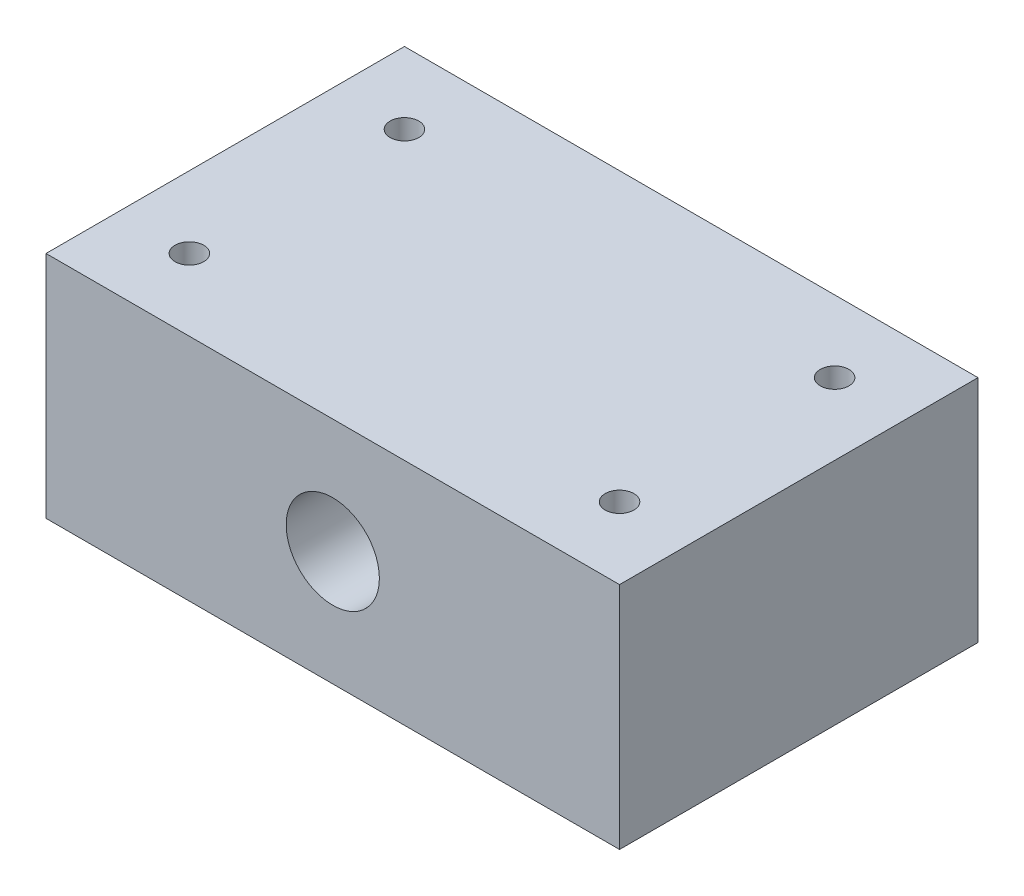
ISO-10303-21;
HEADER;
FILE_DESCRIPTION(('STEP AP214'),'2;1');
FILE_NAME('part.step','',(''),(''),'','','');
FILE_SCHEMA(('AUTOMOTIVE_DESIGN { 1 0 10303 214 1 1 1 1 }'));
ENDSEC;
DATA;
#1=APPLICATION_CONTEXT('core data for automotive mechanical design processes');
#2=APPLICATION_PROTOCOL_DEFINITION('international standard','automotive_design',2000,#1);
#3=PRODUCT_CONTEXT('',#1,'mechanical');
#4=PRODUCT('Part','Part','',(#3));
#5=PRODUCT_RELATED_PRODUCT_CATEGORY('part','',(#4));
#6=PRODUCT_DEFINITION_FORMATION('','',#4);
#7=PRODUCT_DEFINITION_CONTEXT('part definition',#1,'design');
#8=PRODUCT_DEFINITION('design','',#6,#7);
#9=PRODUCT_DEFINITION_SHAPE('','',#8);
#10=(LENGTH_UNIT() NAMED_UNIT(*) SI_UNIT(.MILLI.,.METRE.));
#11=(NAMED_UNIT(*) PLANE_ANGLE_UNIT() SI_UNIT($,.RADIAN.));
#12=(NAMED_UNIT(*) SI_UNIT($,.STERADIAN.) SOLID_ANGLE_UNIT());
#13=UNCERTAINTY_MEASURE_WITH_UNIT(LENGTH_MEASURE(1.E-05),#10,'distance_accuracy_value','');
#14=(GEOMETRIC_REPRESENTATION_CONTEXT(3) GLOBAL_UNCERTAINTY_ASSIGNED_CONTEXT((#13)) GLOBAL_UNIT_ASSIGNED_CONTEXT((#10,
#11,#12)) REPRESENTATION_CONTEXT('',''));
#15=CARTESIAN_POINT('',(0.,0.,0.));
#16=DIRECTION('',(0.,0.,1.));
#17=DIRECTION('',(1.,0.,0.));
#18=AXIS2_PLACEMENT_3D('',#15,#16,#17);
#19=CARTESIAN_POINT('',(0.,32.,0.));
#20=DIRECTION('',(0.,-1.,0.));
#21=DIRECTION('',(0.,0.,-1.));
#22=AXIS2_PLACEMENT_3D('',#19,#20,#21);
#23=PLANE('',#22);
#24=DIRECTION('',(0.,0.,1.));
#25=VECTOR('',#24,1.);
#26=CARTESIAN_POINT('',(0.,32.,0.));
#27=LINE('',#26,#25);
#28=CARTESIAN_POINT('',(0.,32.,-50.));
#29=VERTEX_POINT('',#28);
#30=CARTESIAN_POINT('',(0.,32.,0.));
#31=VERTEX_POINT('',#30);
#32=EDGE_CURVE('E96',#29,#31,#27,.T.);
#33=ORIENTED_EDGE('',*,*,#32,.T.);
#34=DIRECTION('',(1.,0.,0.));
#35=VECTOR('',#34,1.);
#36=CARTESIAN_POINT('',(0.,32.,0.));
#37=LINE('',#36,#35);
#38=CARTESIAN_POINT('',(80.,32.,0.));
#39=VERTEX_POINT('',#38);
#40=EDGE_CURVE('E91',#31,#39,#37,.T.);
#41=ORIENTED_EDGE('',*,*,#40,.T.);
#42=DIRECTION('',(0.,0.,-1.));
#43=VECTOR('',#42,1.);
#44=CARTESIAN_POINT('',(80.,32.,0.));
#45=LINE('',#44,#43);
#46=CARTESIAN_POINT('',(80.,32.,-50.));
#47=VERTEX_POINT('',#46);
#48=EDGE_CURVE('E94',#39,#47,#45,.T.);
#49=ORIENTED_EDGE('',*,*,#48,.T.);
#50=DIRECTION('',(-1.,0.,0.));
#51=VECTOR('',#50,1.);
#52=CARTESIAN_POINT('',(0.,32.,-50.));
#53=LINE('',#52,#51);
#54=EDGE_CURVE('E61',#47,#29,#53,.T.);
#55=ORIENTED_EDGE('',*,*,#54,.T.);
#56=EDGE_LOOP('',(#33,#41,#49,#55));
#57=FACE_BOUND('',#56,.T.);
#58=CARTESIAN_POINT('',(10.,32.,-40.));
#59=DIRECTION('',(0.,1.,0.));
#60=DIRECTION('',(0.,0.,1.));
#61=AXIS2_PLACEMENT_3D('',#58,#59,#60);
#62=CIRCLE('',#61,2.);
#63=CARTESIAN_POINT('',(10.,32.,-38.));
#64=VERTEX_POINT('',#63);
#65=EDGE_CURVE('E116',#64,#64,#62,.T.);
#66=ORIENTED_EDGE('',*,*,#65,.F.);
#67=EDGE_LOOP('',(#66));
#68=FACE_BOUND('',#67,.T.);
#69=CARTESIAN_POINT('',(70.,32.,-40.));
#70=DIRECTION('',(0.,1.,0.));
#71=DIRECTION('',(0.,0.,1.));
#72=AXIS2_PLACEMENT_3D('',#69,#70,#71);
#73=CIRCLE('',#72,2.);
#74=CARTESIAN_POINT('',(70.,32.,-38.));
#75=VERTEX_POINT('',#74);
#76=EDGE_CURVE('E138',#75,#75,#73,.T.);
#77=ORIENTED_EDGE('',*,*,#76,.F.);
#78=EDGE_LOOP('',(#77));
#79=FACE_BOUND('',#78,.T.);
#80=CARTESIAN_POINT('',(70.,32.,-10.));
#81=DIRECTION('',(0.,1.,0.));
#82=DIRECTION('',(0.,0.,1.));
#83=AXIS2_PLACEMENT_3D('',#80,#81,#82);
#84=CIRCLE('',#83,2.);
#85=CARTESIAN_POINT('',(70.,32.,-8.));
#86=VERTEX_POINT('',#85);
#87=EDGE_CURVE('E146',#86,#86,#84,.T.);
#88=ORIENTED_EDGE('',*,*,#87,.F.);
#89=EDGE_LOOP('',(#88));
#90=FACE_BOUND('',#89,.T.);
#91=CARTESIAN_POINT('',(10.,32.,-10.));
#92=DIRECTION('',(0.,1.,0.));
#93=DIRECTION('',(0.,0.,1.));
#94=AXIS2_PLACEMENT_3D('',#91,#92,#93);
#95=CIRCLE('',#94,2.);
#96=CARTESIAN_POINT('',(10.,32.,-8.));
#97=VERTEX_POINT('',#96);
#98=EDGE_CURVE('E154',#97,#97,#95,.T.);
#99=ORIENTED_EDGE('',*,*,#98,.F.);
#100=EDGE_LOOP('',(#99));
#101=FACE_BOUND('',#100,.T.);
#102=ADVANCED_FACE('F43',(#57,#68,#79,#90,#101),#23,.F.);
#103=CARTESIAN_POINT('',(0.,0.,0.));
#104=DIRECTION('',(0.,-1.,0.));
#105=DIRECTION('',(0.,0.,-1.));
#106=AXIS2_PLACEMENT_3D('',#103,#104,#105);
#107=PLANE('',#106);
#108=CARTESIAN_POINT('',(70.,0.,-10.));
#109=DIRECTION('',(0.,1.,0.));
#110=DIRECTION('',(0.,0.,1.));
#111=AXIS2_PLACEMENT_3D('',#108,#109,#110);
#112=CIRCLE('',#111,2.);
#113=CARTESIAN_POINT('',(70.,0.,-8.));
#114=VERTEX_POINT('',#113);
#115=EDGE_CURVE('E150',#114,#114,#112,.T.);
#116=ORIENTED_EDGE('',*,*,#115,.T.);
#117=EDGE_LOOP('',(#116));
#118=FACE_BOUND('',#117,.T.);
#119=CARTESIAN_POINT('',(10.,0.,-40.));
#120=DIRECTION('',(0.,1.,0.));
#121=DIRECTION('',(0.,0.,1.));
#122=AXIS2_PLACEMENT_3D('',#119,#120,#121);
#123=CIRCLE('',#122,2.);
#124=CARTESIAN_POINT('',(10.,0.,-38.));
#125=VERTEX_POINT('',#124);
#126=EDGE_CURVE('E134',#125,#125,#123,.T.);
#127=ORIENTED_EDGE('',*,*,#126,.T.);
#128=EDGE_LOOP('',(#127));
#129=FACE_BOUND('',#128,.T.);
#130=DIRECTION('',(0.,0.,1.));
#131=VECTOR('',#130,1.);
#132=CARTESIAN_POINT('',(0.,0.,0.));
#133=LINE('',#132,#131);
#134=CARTESIAN_POINT('',(0.,0.,-50.));
#135=VERTEX_POINT('',#134);
#136=CARTESIAN_POINT('',(0.,0.,0.));
#137=VERTEX_POINT('',#136);
#138=EDGE_CURVE('E112',#135,#137,#133,.T.);
#139=ORIENTED_EDGE('',*,*,#138,.F.);
#140=DIRECTION('',(-1.,0.,0.));
#141=VECTOR('',#140,1.);
#142=CARTESIAN_POINT('',(0.,0.,-50.));
#143=LINE('',#142,#141);
#144=CARTESIAN_POINT('',(80.,0.,-50.));
#145=VERTEX_POINT('',#144);
#146=EDGE_CURVE('E84',#145,#135,#143,.T.);
#147=ORIENTED_EDGE('',*,*,#146,.F.);
#148=DIRECTION('',(0.,0.,-1.));
#149=VECTOR('',#148,1.);
#150=CARTESIAN_POINT('',(80.,0.,0.));
#151=LINE('',#150,#149);
#152=CARTESIAN_POINT('',(80.,0.,0.));
#153=VERTEX_POINT('',#152);
#154=EDGE_CURVE('E78',#153,#145,#151,.T.);
#155=ORIENTED_EDGE('',*,*,#154,.F.);
#156=DIRECTION('',(1.,0.,0.));
#157=VECTOR('',#156,1.);
#158=CARTESIAN_POINT('',(0.,0.,0.));
#159=LINE('',#158,#157);
#160=EDGE_CURVE('E101',#137,#153,#159,.T.);
#161=ORIENTED_EDGE('',*,*,#160,.F.);
#162=EDGE_LOOP('',(#139,#147,#155,#161));
#163=FACE_BOUND('',#162,.T.);
#164=CARTESIAN_POINT('',(70.,0.,-40.));
#165=DIRECTION('',(0.,1.,0.));
#166=DIRECTION('',(0.,0.,1.));
#167=AXIS2_PLACEMENT_3D('',#164,#165,#166);
#168=CIRCLE('',#167,2.);
#169=CARTESIAN_POINT('',(70.,0.,-38.));
#170=VERTEX_POINT('',#169);
#171=EDGE_CURVE('E142',#170,#170,#168,.T.);
#172=ORIENTED_EDGE('',*,*,#171,.T.);
#173=EDGE_LOOP('',(#172));
#174=FACE_BOUND('',#173,.T.);
#175=CARTESIAN_POINT('',(10.,0.,-10.));
#176=DIRECTION('',(0.,1.,0.));
#177=DIRECTION('',(0.,0.,1.));
#178=AXIS2_PLACEMENT_3D('',#175,#176,#177);
#179=CIRCLE('',#178,2.);
#180=CARTESIAN_POINT('',(10.,0.,-8.));
#181=VERTEX_POINT('',#180);
#182=EDGE_CURVE('E158',#181,#181,#179,.T.);
#183=ORIENTED_EDGE('',*,*,#182,.T.);
#184=EDGE_LOOP('',(#183));
#185=FACE_BOUND('',#184,.T.);
#186=ADVANCED_FACE('F129',(#118,#129,#163,#174,#185),#107,.T.);
#187=CARTESIAN_POINT('',(0.,32.,0.));
#188=DIRECTION('',(1.,0.,0.));
#189=DIRECTION('',(0.,0.,-1.));
#190=AXIS2_PLACEMENT_3D('',#187,#188,#189);
#191=PLANE('',#190);
#192=ORIENTED_EDGE('',*,*,#138,.T.);
#193=DIRECTION('',(0.,-1.,0.));
#194=VECTOR('',#193,1.);
#195=CARTESIAN_POINT('',(0.,32.,0.));
#196=LINE('',#195,#194);
#197=EDGE_CURVE('E11',#31,#137,#196,.T.);
#198=ORIENTED_EDGE('',*,*,#197,.F.);
#199=ORIENTED_EDGE('',*,*,#32,.F.);
#200=DIRECTION('',(0.,-1.,0.));
#201=VECTOR('',#200,1.);
#202=CARTESIAN_POINT('',(0.,32.,-50.));
#203=LINE('',#202,#201);
#204=EDGE_CURVE('E108',#29,#135,#203,.T.);
#205=ORIENTED_EDGE('',*,*,#204,.T.);
#206=EDGE_LOOP('',(#192,#198,#199,#205));
#207=FACE_BOUND('',#206,.T.);
#208=ADVANCED_FACE('F45',(#207),#191,.F.);
#209=CARTESIAN_POINT('',(0.,32.,0.));
#210=DIRECTION('',(0.,0.,-1.));
#211=DIRECTION('',(-1.,0.,0.));
#212=AXIS2_PLACEMENT_3D('',#209,#210,#211);
#213=PLANE('',#212);
#214=CARTESIAN_POINT('',(40.,16.,0.));
#215=DIRECTION('',(0.,0.,1.));
#216=DIRECTION('',(1.,0.,0.));
#217=AXIS2_PLACEMENT_3D('',#214,#215,#216);
#218=CIRCLE('',#217,6.5);
#219=CARTESIAN_POINT('',(46.5,16.,0.));
#220=VERTEX_POINT('',#219);
#221=EDGE_CURVE('E166',#220,#220,#218,.T.);
#222=ORIENTED_EDGE('',*,*,#221,.F.);
#223=EDGE_LOOP('',(#222));
#224=FACE_BOUND('',#223,.T.);
#225=ORIENTED_EDGE('',*,*,#160,.T.);
#226=DIRECTION('',(0.,-1.,0.));
#227=VECTOR('',#226,1.);
#228=CARTESIAN_POINT('',(80.,32.,0.));
#229=LINE('',#228,#227);
#230=EDGE_CURVE('E53',#39,#153,#229,.T.);
#231=ORIENTED_EDGE('',*,*,#230,.F.);
#232=ORIENTED_EDGE('',*,*,#40,.F.);
#233=ORIENTED_EDGE('',*,*,#197,.T.);
#234=EDGE_LOOP('',(#225,#231,#232,#233));
#235=FACE_BOUND('',#234,.T.);
#236=ADVANCED_FACE('F100',(#224,#235),#213,.F.);
#237=CARTESIAN_POINT('',(80.,32.,0.));
#238=DIRECTION('',(-1.,0.,0.));
#239=DIRECTION('',(0.,0.,1.));
#240=AXIS2_PLACEMENT_3D('',#237,#238,#239);
#241=PLANE('',#240);
#242=ORIENTED_EDGE('',*,*,#154,.T.);
#243=DIRECTION('',(0.,-1.,0.));
#244=VECTOR('',#243,1.);
#245=CARTESIAN_POINT('',(80.,32.,-50.));
#246=LINE('',#245,#244);
#247=EDGE_CURVE('E103',#47,#145,#246,.T.);
#248=ORIENTED_EDGE('',*,*,#247,.F.);
#249=ORIENTED_EDGE('',*,*,#48,.F.);
#250=ORIENTED_EDGE('',*,*,#230,.T.);
#251=EDGE_LOOP('',(#242,#248,#249,#250));
#252=FACE_BOUND('',#251,.T.);
#253=ADVANCED_FACE('F104',(#252),#241,.F.);
#254=CARTESIAN_POINT('',(0.,32.,-50.));
#255=DIRECTION('',(0.,0.,1.));
#256=DIRECTION('',(1.,0.,0.));
#257=AXIS2_PLACEMENT_3D('',#254,#255,#256);
#258=PLANE('',#257);
#259=CARTESIAN_POINT('',(40.,16.,-50.));
#260=DIRECTION('',(0.,0.,1.));
#261=DIRECTION('',(1.,0.,0.));
#262=AXIS2_PLACEMENT_3D('',#259,#260,#261);
#263=CIRCLE('',#262,6.5);
#264=CARTESIAN_POINT('',(46.5,16.,-50.));
#265=VERTEX_POINT('',#264);
#266=EDGE_CURVE('E162',#265,#265,#263,.T.);
#267=ORIENTED_EDGE('',*,*,#266,.T.);
#268=EDGE_LOOP('',(#267));
#269=FACE_BOUND('',#268,.T.);
#270=ORIENTED_EDGE('',*,*,#146,.T.);
#271=ORIENTED_EDGE('',*,*,#204,.F.);
#272=ORIENTED_EDGE('',*,*,#54,.F.);
#273=ORIENTED_EDGE('',*,*,#247,.T.);
#274=EDGE_LOOP('',(#270,#271,#272,#273));
#275=FACE_BOUND('',#274,.T.);
#276=ADVANCED_FACE('F126',(#269,#275),#258,.F.);
#277=CARTESIAN_POINT('',(10.,32.,-40.));
#278=DIRECTION('',(0.,-1.,0.));
#279=DIRECTION('',(0.,0.,-1.));
#280=AXIS2_PLACEMENT_3D('',#277,#278,#279);
#281=CYLINDRICAL_SURFACE('',#280,2.);
#282=ORIENTED_EDGE('',*,*,#65,.T.);
#283=EDGE_LOOP('',(#282));
#284=FACE_BOUND('',#283,.T.);
#285=ORIENTED_EDGE('',*,*,#126,.F.);
#286=EDGE_LOOP('',(#285));
#287=FACE_BOUND('',#286,.T.);
#288=ADVANCED_FACE('F196',(#284,#287),#281,.F.);
#289=CARTESIAN_POINT('',(70.,32.,-40.));
#290=DIRECTION('',(0.,-1.,0.));
#291=DIRECTION('',(0.,0.,-1.));
#292=AXIS2_PLACEMENT_3D('',#289,#290,#291);
#293=CYLINDRICAL_SURFACE('',#292,2.);
#294=ORIENTED_EDGE('',*,*,#76,.T.);
#295=EDGE_LOOP('',(#294));
#296=FACE_BOUND('',#295,.T.);
#297=ORIENTED_EDGE('',*,*,#171,.F.);
#298=EDGE_LOOP('',(#297));
#299=FACE_BOUND('',#298,.T.);
#300=ADVANCED_FACE('F203',(#296,#299),#293,.F.);
#301=CARTESIAN_POINT('',(70.,32.,-10.));
#302=DIRECTION('',(0.,-1.,0.));
#303=DIRECTION('',(0.,0.,-1.));
#304=AXIS2_PLACEMENT_3D('',#301,#302,#303);
#305=CYLINDRICAL_SURFACE('',#304,2.);
#306=ORIENTED_EDGE('',*,*,#87,.T.);
#307=EDGE_LOOP('',(#306));
#308=FACE_BOUND('',#307,.T.);
#309=ORIENTED_EDGE('',*,*,#115,.F.);
#310=EDGE_LOOP('',(#309));
#311=FACE_BOUND('',#310,.T.);
#312=ADVANCED_FACE('F208',(#308,#311),#305,.F.);
#313=CARTESIAN_POINT('',(10.,32.,-10.));
#314=DIRECTION('',(0.,-1.,0.));
#315=DIRECTION('',(0.,0.,-1.));
#316=AXIS2_PLACEMENT_3D('',#313,#314,#315);
#317=CYLINDRICAL_SURFACE('',#316,2.);
#318=ORIENTED_EDGE('',*,*,#98,.T.);
#319=EDGE_LOOP('',(#318));
#320=FACE_BOUND('',#319,.T.);
#321=ORIENTED_EDGE('',*,*,#182,.F.);
#322=EDGE_LOOP('',(#321));
#323=FACE_BOUND('',#322,.T.);
#324=ADVANCED_FACE('F178',(#320,#323),#317,.F.);
#325=CARTESIAN_POINT('',(40.,16.,-50.));
#326=DIRECTION('',(0.,0.,1.));
#327=DIRECTION('',(1.,0.,0.));
#328=AXIS2_PLACEMENT_3D('',#325,#326,#327);
#329=CYLINDRICAL_SURFACE('',#328,6.5);
#330=ORIENTED_EDGE('',*,*,#266,.F.);
#331=EDGE_LOOP('',(#330));
#332=FACE_BOUND('',#331,.T.);
#333=ORIENTED_EDGE('',*,*,#221,.T.);
#334=EDGE_LOOP('',(#333));
#335=FACE_BOUND('',#334,.T.);
#336=ADVANCED_FACE('F175',(#332,#335),#329,.F.);
#337=CLOSED_SHELL('',(#102,#186,#208,#236,#253,#276,#288,#300,#312,#324,#336));
#338=MANIFOLD_SOLID_BREP('B2',#337);
#339=ADVANCED_BREP_SHAPE_REPRESENTATION('',(#18,#338),#14);
#340=SHAPE_DEFINITION_REPRESENTATION(#9,#339);
ENDSEC;
END-ISO-10303-21;
